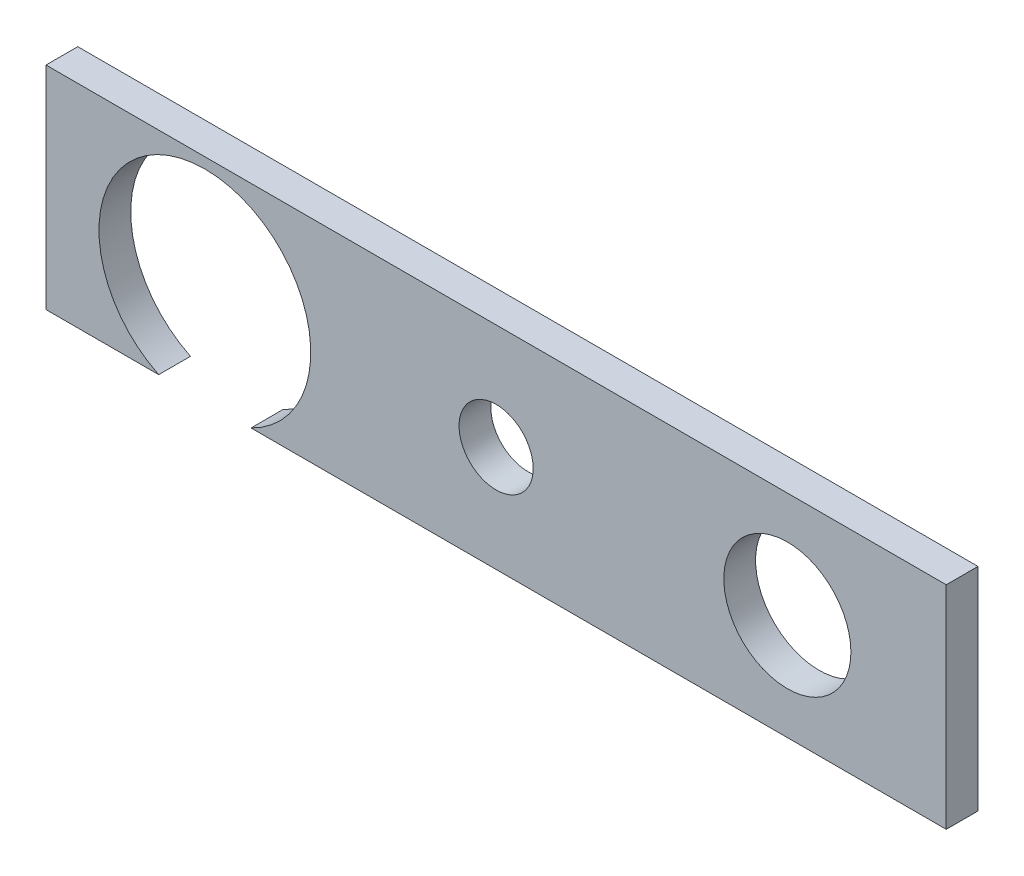
ISO-10303-21;
HEADER;
FILE_DESCRIPTION(('STEP AP214'),'2;1');
FILE_NAME('part.step','',(''),(''),'','','');
FILE_SCHEMA(('AUTOMOTIVE_DESIGN { 1 0 10303 214 1 1 1 1 }'));
ENDSEC;
DATA;
#1=APPLICATION_CONTEXT('core data for automotive mechanical design processes');
#2=APPLICATION_PROTOCOL_DEFINITION('international standard','automotive_design',2000,#1);
#3=PRODUCT_CONTEXT('',#1,'mechanical');
#4=PRODUCT('Part','Part','',(#3));
#5=PRODUCT_RELATED_PRODUCT_CATEGORY('part','',(#4));
#6=PRODUCT_DEFINITION_FORMATION('','',#4);
#7=PRODUCT_DEFINITION_CONTEXT('part definition',#1,'design');
#8=PRODUCT_DEFINITION('design','',#6,#7);
#9=PRODUCT_DEFINITION_SHAPE('','',#8);
#10=(LENGTH_UNIT() NAMED_UNIT(*) SI_UNIT(.MILLI.,.METRE.));
#11=(NAMED_UNIT(*) PLANE_ANGLE_UNIT() SI_UNIT($,.RADIAN.));
#12=(NAMED_UNIT(*) SI_UNIT($,.STERADIAN.) SOLID_ANGLE_UNIT());
#13=UNCERTAINTY_MEASURE_WITH_UNIT(LENGTH_MEASURE(1.E-05),#10,'distance_accuracy_value','');
#14=(GEOMETRIC_REPRESENTATION_CONTEXT(3) GLOBAL_UNCERTAINTY_ASSIGNED_CONTEXT((#13)) GLOBAL_UNIT_ASSIGNED_CONTEXT((#10,
#11,#12)) REPRESENTATION_CONTEXT('',''));
#15=CARTESIAN_POINT('',(0.,0.,0.));
#16=DIRECTION('',(0.,0.,1.));
#17=DIRECTION('',(1.,0.,0.));
#18=AXIS2_PLACEMENT_3D('',#15,#16,#17);
#19=CARTESIAN_POINT('',(0.,0.,3.));
#20=DIRECTION('',(0.,1.,0.));
#21=DIRECTION('',(0.,0.,1.));
#22=AXIS2_PLACEMENT_3D('',#19,#20,#21);
#23=PLANE('',#22);
#24=DIRECTION('',(1.,0.,0.));
#25=VECTOR('',#24,1.);
#26=CARTESIAN_POINT('',(0.,0.,0.));
#27=LINE('',#26,#25);
#28=CARTESIAN_POINT('',(0.,0.,0.));
#29=VERTEX_POINT('',#28);
#30=CARTESIAN_POINT('',(10.6411010564593,0.,0.));
#31=VERTEX_POINT('',#30);
#32=EDGE_CURVE('E120',#29,#31,#27,.T.);
#33=ORIENTED_EDGE('',*,*,#32,.T.);
#34=DIRECTION('',(0.,0.,1.));
#35=VECTOR('',#34,1.);
#36=CARTESIAN_POINT('',(10.6411010564593,0.,0.));
#37=LINE('',#36,#35);
#38=CARTESIAN_POINT('',(10.6411010564593,0.,3.));
#39=VERTEX_POINT('',#38);
#40=EDGE_CURVE('E54',#31,#39,#37,.T.);
#41=ORIENTED_EDGE('',*,*,#40,.T.);
#42=DIRECTION('',(1.,0.,0.));
#43=VECTOR('',#42,1.);
#44=CARTESIAN_POINT('',(0.,0.,3.));
#45=LINE('',#44,#43);
#46=CARTESIAN_POINT('',(0.,0.,3.));
#47=VERTEX_POINT('',#46);
#48=EDGE_CURVE('E137',#47,#39,#45,.T.);
#49=ORIENTED_EDGE('',*,*,#48,.F.);
#50=DIRECTION('',(0.,0.,-1.));
#51=VECTOR('',#50,1.);
#52=CARTESIAN_POINT('',(0.,0.,3.));
#53=LINE('',#52,#51);
#54=EDGE_CURVE('E48',#47,#29,#53,.T.);
#55=ORIENTED_EDGE('',*,*,#54,.T.);
#56=EDGE_LOOP('',(#33,#41,#49,#55));
#57=FACE_BOUND('',#56,.T.);
#58=ADVANCED_FACE('F39',(#57),#23,.F.);
#59=CARTESIAN_POINT('',(0.,0.,3.));
#60=DIRECTION('',(-1.,0.,0.));
#61=DIRECTION('',(0.,0.,1.));
#62=AXIS2_PLACEMENT_3D('',#59,#60,#61);
#63=PLANE('',#62);
#64=DIRECTION('',(0.,1.,0.));
#65=VECTOR('',#64,1.);
#66=CARTESIAN_POINT('',(0.,0.,0.));
#67=LINE('',#66,#65);
#68=CARTESIAN_POINT('',(0.,20.,0.));
#69=VERTEX_POINT('',#68);
#70=EDGE_CURVE('E148',#29,#69,#67,.T.);
#71=ORIENTED_EDGE('',*,*,#70,.F.);
#72=ORIENTED_EDGE('',*,*,#54,.F.);
#73=DIRECTION('',(0.,1.,0.));
#74=VECTOR('',#73,1.);
#75=CARTESIAN_POINT('',(0.,0.,3.));
#76=LINE('',#75,#74);
#77=CARTESIAN_POINT('',(0.,20.,3.));
#78=VERTEX_POINT('',#77);
#79=EDGE_CURVE('E124',#47,#78,#76,.T.);
#80=ORIENTED_EDGE('',*,*,#79,.T.);
#81=DIRECTION('',(0.,0.,-1.));
#82=VECTOR('',#81,1.);
#83=CARTESIAN_POINT('',(0.,20.,3.));
#84=LINE('',#83,#82);
#85=EDGE_CURVE('E88',#78,#69,#84,.T.);
#86=ORIENTED_EDGE('',*,*,#85,.T.);
#87=EDGE_LOOP('',(#71,#72,#80,#86));
#88=FACE_BOUND('',#87,.T.);
#89=ADVANCED_FACE('F41',(#88),#63,.T.);
#90=CARTESIAN_POINT('',(19.3588989435407,0.,3.));
#91=VERTEX_POINT('',#90);
#92=CARTESIAN_POINT('',(85.,0.,3.));
#93=VERTEX_POINT('',#92);
#94=EDGE_CURVE('E109',#91,#93,#45,.T.);
#95=ORIENTED_EDGE('',*,*,#94,.F.);
#96=DIRECTION('',(0.,0.,1.));
#97=VECTOR('',#96,1.);
#98=CARTESIAN_POINT('',(19.3588989435407,0.,0.));
#99=LINE('',#98,#97);
#100=CARTESIAN_POINT('',(19.3588989435407,0.,0.));
#101=VERTEX_POINT('',#100);
#102=EDGE_CURVE('E99',#91,#101,#99,.F.);
#103=ORIENTED_EDGE('',*,*,#102,.T.);
#104=CARTESIAN_POINT('',(85.,0.,0.));
#105=VERTEX_POINT('',#104);
#106=EDGE_CURVE('E107',#101,#105,#27,.T.);
#107=ORIENTED_EDGE('',*,*,#106,.T.);
#108=DIRECTION('',(0.,0.,-1.));
#109=VECTOR('',#108,1.);
#110=CARTESIAN_POINT('',(85.,0.,3.));
#111=LINE('',#110,#109);
#112=EDGE_CURVE('E131',#93,#105,#111,.T.);
#113=ORIENTED_EDGE('',*,*,#112,.F.);
#114=EDGE_LOOP('',(#95,#103,#107,#113));
#115=FACE_BOUND('',#114,.T.);
#116=ADVANCED_FACE('F105',(#115),#23,.F.);
#117=CARTESIAN_POINT('',(85.,0.,3.));
#118=DIRECTION('',(-1.,0.,0.));
#119=DIRECTION('',(0.,0.,1.));
#120=AXIS2_PLACEMENT_3D('',#117,#118,#119);
#121=PLANE('',#120);
#122=DIRECTION('',(0.,1.,0.));
#123=VECTOR('',#122,1.);
#124=CARTESIAN_POINT('',(85.,0.,0.));
#125=LINE('',#124,#123);
#126=CARTESIAN_POINT('',(85.,20.,0.));
#127=VERTEX_POINT('',#126);
#128=EDGE_CURVE('E118',#105,#127,#125,.T.);
#129=ORIENTED_EDGE('',*,*,#128,.T.);
#130=DIRECTION('',(0.,0.,-1.));
#131=VECTOR('',#130,1.);
#132=CARTESIAN_POINT('',(85.,20.,3.));
#133=LINE('',#132,#131);
#134=CARTESIAN_POINT('',(85.,20.,3.));
#135=VERTEX_POINT('',#134);
#136=EDGE_CURVE('E134',#135,#127,#133,.T.);
#137=ORIENTED_EDGE('',*,*,#136,.F.);
#138=DIRECTION('',(0.,1.,0.));
#139=VECTOR('',#138,1.);
#140=CARTESIAN_POINT('',(85.,0.,3.));
#141=LINE('',#140,#139);
#142=EDGE_CURVE('E144',#93,#135,#141,.T.);
#143=ORIENTED_EDGE('',*,*,#142,.F.);
#144=ORIENTED_EDGE('',*,*,#112,.T.);
#145=EDGE_LOOP('',(#129,#137,#143,#144));
#146=FACE_BOUND('',#145,.T.);
#147=ADVANCED_FACE('F157',(#146),#121,.F.);
#148=CARTESIAN_POINT('',(0.,20.,3.));
#149=DIRECTION('',(0.,1.,0.));
#150=DIRECTION('',(0.,0.,1.));
#151=AXIS2_PLACEMENT_3D('',#148,#149,#150);
#152=PLANE('',#151);
#153=DIRECTION('',(1.,0.,0.));
#154=VECTOR('',#153,1.);
#155=CARTESIAN_POINT('',(0.,20.,0.));
#156=LINE('',#155,#154);
#157=EDGE_CURVE('E125',#69,#127,#156,.T.);
#158=ORIENTED_EDGE('',*,*,#157,.F.);
#159=ORIENTED_EDGE('',*,*,#85,.F.);
#160=DIRECTION('',(1.,0.,0.));
#161=VECTOR('',#160,1.);
#162=CARTESIAN_POINT('',(0.,20.,3.));
#163=LINE('',#162,#161);
#164=EDGE_CURVE('E154',#78,#135,#163,.T.);
#165=ORIENTED_EDGE('',*,*,#164,.T.);
#166=ORIENTED_EDGE('',*,*,#136,.T.);
#167=EDGE_LOOP('',(#158,#159,#165,#166));
#168=FACE_BOUND('',#167,.T.);
#169=ADVANCED_FACE('F152',(#168),#152,.T.);
#170=CARTESIAN_POINT('',(0.,0.,3.));
#171=DIRECTION('',(0.,0.,-1.));
#172=DIRECTION('',(-1.,0.,0.));
#173=AXIS2_PLACEMENT_3D('',#170,#171,#172);
#174=PLANE('',#173);
#175=CARTESIAN_POINT('',(70.,10.,3.));
#176=DIRECTION('',(0.,0.,1.));
#177=DIRECTION('',(1.,0.,0.));
#178=AXIS2_PLACEMENT_3D('',#175,#176,#177);
#179=CIRCLE('',#178,6.);
#180=CARTESIAN_POINT('',(76.,10.,3.));
#181=VERTEX_POINT('',#180);
#182=EDGE_CURVE('E176',#181,#181,#179,.T.);
#183=ORIENTED_EDGE('',*,*,#182,.F.);
#184=EDGE_LOOP('',(#183));
#185=FACE_BOUND('',#184,.T.);
#186=CARTESIAN_POINT('',(42.5,10.,3.));
#187=DIRECTION('',(0.,0.,1.));
#188=DIRECTION('',(1.,0.,0.));
#189=AXIS2_PLACEMENT_3D('',#186,#187,#188);
#190=CIRCLE('',#189,3.5);
#191=CARTESIAN_POINT('',(46.,10.,3.));
#192=VERTEX_POINT('',#191);
#193=EDGE_CURVE('E165',#192,#192,#190,.T.);
#194=ORIENTED_EDGE('',*,*,#193,.F.);
#195=EDGE_LOOP('',(#194));
#196=FACE_BOUND('',#195,.T.);
#197=ORIENTED_EDGE('',*,*,#48,.T.);
#198=CARTESIAN_POINT('',(15.,9.,3.));
#199=DIRECTION('',(0.,0.,1.));
#200=DIRECTION('',(1.,0.,0.));
#201=AXIS2_PLACEMENT_3D('',#198,#199,#200);
#202=CIRCLE('',#201,10.);
#203=EDGE_CURVE('E173',#91,#39,#202,.T.);
#204=ORIENTED_EDGE('',*,*,#203,.F.);
#205=ORIENTED_EDGE('',*,*,#94,.T.);
#206=ORIENTED_EDGE('',*,*,#142,.T.);
#207=ORIENTED_EDGE('',*,*,#164,.F.);
#208=ORIENTED_EDGE('',*,*,#79,.F.);
#209=EDGE_LOOP('',(#197,#204,#205,#206,#207,#208));
#210=FACE_BOUND('',#209,.T.);
#211=ADVANCED_FACE('F192',(#185,#196,#210),#174,.F.);
#212=CARTESIAN_POINT('',(0.,0.,0.));
#213=DIRECTION('',(0.,0.,-1.));
#214=DIRECTION('',(-1.,0.,0.));
#215=AXIS2_PLACEMENT_3D('',#212,#213,#214);
#216=PLANE('',#215);
#217=CARTESIAN_POINT('',(15.,9.,0.));
#218=DIRECTION('',(0.,0.,-1.));
#219=DIRECTION('',(-1.,0.,0.));
#220=AXIS2_PLACEMENT_3D('',#217,#218,#219);
#221=CIRCLE('',#220,10.);
#222=EDGE_CURVE('E11',#31,#101,#221,.T.);
#223=ORIENTED_EDGE('',*,*,#222,.F.);
#224=ORIENTED_EDGE('',*,*,#32,.F.);
#225=ORIENTED_EDGE('',*,*,#70,.T.);
#226=ORIENTED_EDGE('',*,*,#157,.T.);
#227=ORIENTED_EDGE('',*,*,#128,.F.);
#228=ORIENTED_EDGE('',*,*,#106,.F.);
#229=EDGE_LOOP('',(#223,#224,#225,#226,#227,#228));
#230=FACE_BOUND('',#229,.T.);
#231=CARTESIAN_POINT('',(70.,10.,0.));
#232=DIRECTION('',(0.,0.,1.));
#233=DIRECTION('',(1.,0.,0.));
#234=AXIS2_PLACEMENT_3D('',#231,#232,#233);
#235=CIRCLE('',#234,6.);
#236=CARTESIAN_POINT('',(76.,10.,0.));
#237=VERTEX_POINT('',#236);
#238=EDGE_CURVE('E169',#237,#237,#235,.T.);
#239=ORIENTED_EDGE('',*,*,#238,.T.);
#240=EDGE_LOOP('',(#239));
#241=FACE_BOUND('',#240,.T.);
#242=CARTESIAN_POINT('',(42.5,10.,0.));
#243=DIRECTION('',(0.,0.,1.));
#244=DIRECTION('',(1.,0.,0.));
#245=AXIS2_PLACEMENT_3D('',#242,#243,#244);
#246=CIRCLE('',#245,3.5);
#247=CARTESIAN_POINT('',(46.,10.,0.));
#248=VERTEX_POINT('',#247);
#249=EDGE_CURVE('E111',#248,#248,#246,.T.);
#250=ORIENTED_EDGE('',*,*,#249,.T.);
#251=EDGE_LOOP('',(#250));
#252=FACE_BOUND('',#251,.T.);
#253=ADVANCED_FACE('F114',(#230,#241,#252),#216,.T.);
#254=CARTESIAN_POINT('',(42.5,10.,0.));
#255=DIRECTION('',(0.,0.,1.));
#256=DIRECTION('',(1.,0.,0.));
#257=AXIS2_PLACEMENT_3D('',#254,#255,#256);
#258=CYLINDRICAL_SURFACE('',#257,3.5);
#259=ORIENTED_EDGE('',*,*,#249,.F.);
#260=EDGE_LOOP('',(#259));
#261=FACE_BOUND('',#260,.T.);
#262=ORIENTED_EDGE('',*,*,#193,.T.);
#263=EDGE_LOOP('',(#262));
#264=FACE_BOUND('',#263,.T.);
#265=ADVANCED_FACE('F188',(#261,#264),#258,.F.);
#266=CARTESIAN_POINT('',(70.,10.,0.));
#267=DIRECTION('',(0.,0.,1.));
#268=DIRECTION('',(1.,0.,0.));
#269=AXIS2_PLACEMENT_3D('',#266,#267,#268);
#270=CYLINDRICAL_SURFACE('',#269,6.);
#271=ORIENTED_EDGE('',*,*,#238,.F.);
#272=EDGE_LOOP('',(#271));
#273=FACE_BOUND('',#272,.T.);
#274=ORIENTED_EDGE('',*,*,#182,.T.);
#275=EDGE_LOOP('',(#274));
#276=FACE_BOUND('',#275,.T.);
#277=ADVANCED_FACE('F185',(#273,#276),#270,.F.);
#278=CARTESIAN_POINT('',(15.,9.,0.));
#279=DIRECTION('',(0.,0.,1.));
#280=DIRECTION('',(1.,0.,0.));
#281=AXIS2_PLACEMENT_3D('',#278,#279,#280);
#282=CYLINDRICAL_SURFACE('',#281,10.);
#283=ORIENTED_EDGE('',*,*,#222,.T.);
#284=ORIENTED_EDGE('',*,*,#102,.F.);
#285=ORIENTED_EDGE('',*,*,#203,.T.);
#286=ORIENTED_EDGE('',*,*,#40,.F.);
#287=EDGE_LOOP('',(#283,#284,#285,#286));
#288=FACE_BOUND('',#287,.T.);
#289=ADVANCED_FACE('F98',(#288),#282,.F.);
#290=CLOSED_SHELL('',(#58,#89,#116,#147,#169,#211,#253,#265,#277,#289));
#291=MANIFOLD_SOLID_BREP('B2',#290);
#292=ADVANCED_BREP_SHAPE_REPRESENTATION('',(#18,#291),#14);
#293=SHAPE_DEFINITION_REPRESENTATION(#9,#292);
ENDSEC;
END-ISO-10303-21;
